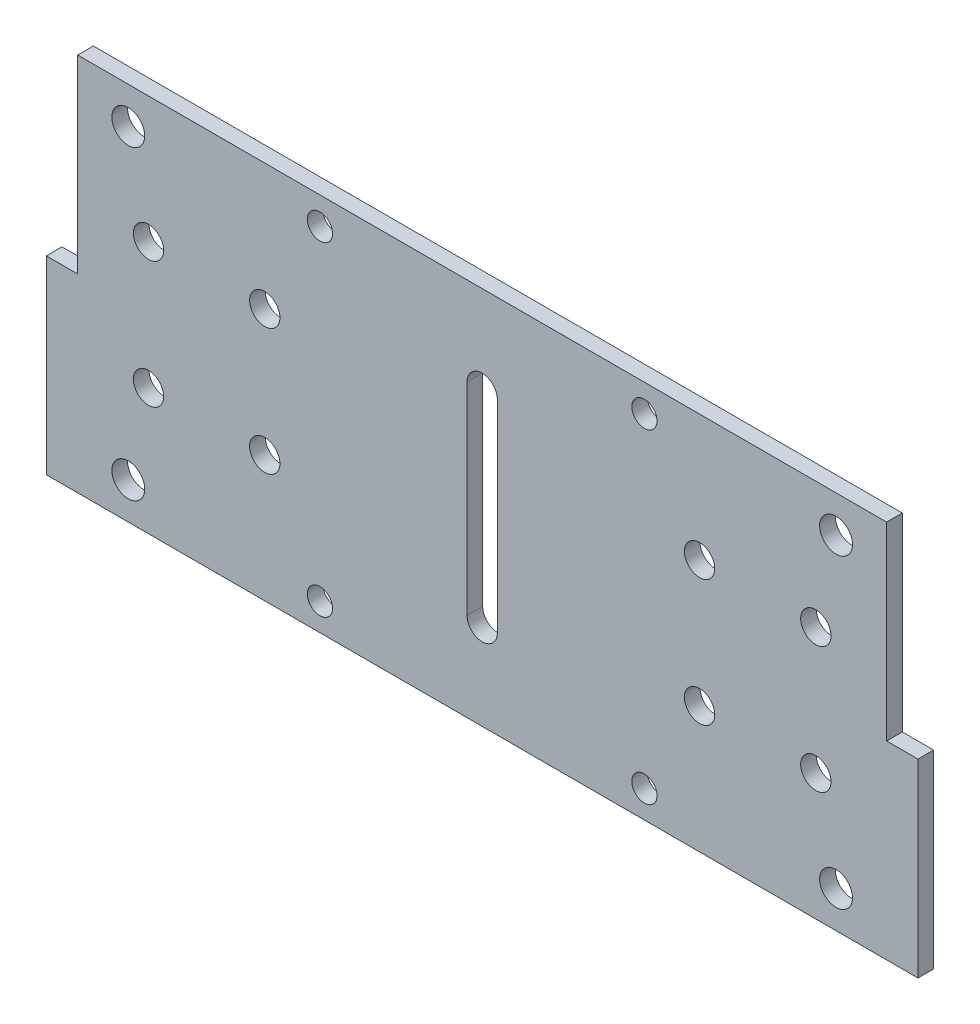
ISO-10303-21;
HEADER;
FILE_DESCRIPTION(('STEP AP214'),'2;1');
FILE_NAME('part.step','',(''),(''),'','','');
FILE_SCHEMA(('AUTOMOTIVE_DESIGN { 1 0 10303 214 1 1 1 1 }'));
ENDSEC;
DATA;
#1=APPLICATION_CONTEXT('core data for automotive mechanical design processes');
#2=APPLICATION_PROTOCOL_DEFINITION('international standard','automotive_design',2000,#1);
#3=PRODUCT_CONTEXT('',#1,'mechanical');
#4=PRODUCT('Part','Part','',(#3));
#5=PRODUCT_RELATED_PRODUCT_CATEGORY('part','',(#4));
#6=PRODUCT_DEFINITION_FORMATION('','',#4);
#7=PRODUCT_DEFINITION_CONTEXT('part definition',#1,'design');
#8=PRODUCT_DEFINITION('design','',#6,#7);
#9=PRODUCT_DEFINITION_SHAPE('','',#8);
#10=(LENGTH_UNIT() NAMED_UNIT(*) SI_UNIT(.MILLI.,.METRE.));
#11=(NAMED_UNIT(*) PLANE_ANGLE_UNIT() SI_UNIT($,.RADIAN.));
#12=(NAMED_UNIT(*) SI_UNIT($,.STERADIAN.) SOLID_ANGLE_UNIT());
#13=UNCERTAINTY_MEASURE_WITH_UNIT(LENGTH_MEASURE(1.E-05),#10,'distance_accuracy_value','');
#14=(GEOMETRIC_REPRESENTATION_CONTEXT(3) GLOBAL_UNCERTAINTY_ASSIGNED_CONTEXT((#13)) GLOBAL_UNIT_ASSIGNED_CONTEXT((#10,
#11,#12)) REPRESENTATION_CONTEXT('',''));
#15=CARTESIAN_POINT('',(0.,0.,0.));
#16=DIRECTION('',(0.,0.,1.));
#17=DIRECTION('',(1.,0.,0.));
#18=AXIS2_PLACEMENT_3D('',#15,#16,#17);
#19=CARTESIAN_POINT('',(80.,-37.5,3.1));
#20=DIRECTION('',(-1.,0.,0.));
#21=DIRECTION('',(0.,0.,1.));
#22=AXIS2_PLACEMENT_3D('',#19,#20,#21);
#23=PLANE('',#22);
#24=DIRECTION('',(0.,0.,1.));
#25=VECTOR('',#24,1.);
#26=CARTESIAN_POINT('',(80.,0.,0.));
#27=LINE('',#26,#25);
#28=CARTESIAN_POINT('',(80.,0.,0.));
#29=VERTEX_POINT('',#28);
#30=CARTESIAN_POINT('',(80.,0.,3.1));
#31=VERTEX_POINT('',#30);
#32=EDGE_CURVE('E304',#29,#31,#27,.T.);
#33=ORIENTED_EDGE('',*,*,#32,.F.);
#34=DIRECTION('',(0.,1.,0.));
#35=VECTOR('',#34,1.);
#36=CARTESIAN_POINT('',(80.,-37.5,0.));
#37=LINE('',#36,#35);
#38=CARTESIAN_POINT('',(80.,37.5,0.));
#39=VERTEX_POINT('',#38);
#40=EDGE_CURVE('E307',#29,#39,#37,.T.);
#41=ORIENTED_EDGE('',*,*,#40,.T.);
#42=DIRECTION('',(0.,0.,-1.));
#43=VECTOR('',#42,1.);
#44=CARTESIAN_POINT('',(80.,37.5,3.1));
#45=LINE('',#44,#43);
#46=CARTESIAN_POINT('',(80.,37.5,3.1));
#47=VERTEX_POINT('',#46);
#48=EDGE_CURVE('E200',#47,#39,#45,.T.);
#49=ORIENTED_EDGE('',*,*,#48,.F.);
#50=DIRECTION('',(0.,1.,0.));
#51=VECTOR('',#50,1.);
#52=CARTESIAN_POINT('',(80.,-37.5,3.1));
#53=LINE('',#52,#51);
#54=EDGE_CURVE('E309',#31,#47,#53,.T.);
#55=ORIENTED_EDGE('',*,*,#54,.F.);
#56=EDGE_LOOP('',(#33,#41,#49,#55));
#57=FACE_BOUND('',#56,.T.);
#58=ADVANCED_FACE('F32',(#57),#23,.F.);
#59=CARTESIAN_POINT('',(-80.,37.5,3.1));
#60=DIRECTION('',(0.,-1.,0.));
#61=DIRECTION('',(0.,0.,-1.));
#62=AXIS2_PLACEMENT_3D('',#59,#60,#61);
#63=PLANE('',#62);
#64=DIRECTION('',(-1.,0.,0.));
#65=VECTOR('',#64,1.);
#66=CARTESIAN_POINT('',(-80.,37.5,0.));
#67=LINE('',#66,#65);
#68=CARTESIAN_POINT('',(-80.,37.5,0.));
#69=VERTEX_POINT('',#68);
#70=EDGE_CURVE('E323',#39,#69,#67,.T.);
#71=ORIENTED_EDGE('',*,*,#70,.T.);
#72=DIRECTION('',(0.,0.,-1.));
#73=VECTOR('',#72,1.);
#74=CARTESIAN_POINT('',(-80.,37.5,3.1));
#75=LINE('',#74,#73);
#76=CARTESIAN_POINT('',(-80.,37.5,3.1));
#77=VERTEX_POINT('',#76);
#78=EDGE_CURVE('E350',#77,#69,#75,.T.);
#79=ORIENTED_EDGE('',*,*,#78,.F.);
#80=DIRECTION('',(-1.,0.,0.));
#81=VECTOR('',#80,1.);
#82=CARTESIAN_POINT('',(-80.,37.5,3.1));
#83=LINE('',#82,#81);
#84=EDGE_CURVE('E360',#47,#77,#83,.T.);
#85=ORIENTED_EDGE('',*,*,#84,.F.);
#86=ORIENTED_EDGE('',*,*,#48,.T.);
#87=EDGE_LOOP('',(#71,#79,#85,#86));
#88=FACE_BOUND('',#87,.T.);
#89=ADVANCED_FACE('F297',(#88),#63,.F.);
#90=CARTESIAN_POINT('',(-80.,-37.5,3.1));
#91=DIRECTION('',(1.,0.,0.));
#92=DIRECTION('',(0.,0.,-1.));
#93=AXIS2_PLACEMENT_3D('',#90,#91,#92);
#94=PLANE('',#93);
#95=DIRECTION('',(0.,-1.,0.));
#96=VECTOR('',#95,1.);
#97=CARTESIAN_POINT('',(-80.,-37.5,0.));
#98=LINE('',#97,#96);
#99=CARTESIAN_POINT('',(-80.,0.,0.));
#100=VERTEX_POINT('',#99);
#101=EDGE_CURVE('E338',#69,#100,#98,.T.);
#102=ORIENTED_EDGE('',*,*,#101,.T.);
#103=DIRECTION('',(0.,0.,1.));
#104=VECTOR('',#103,1.);
#105=CARTESIAN_POINT('',(-80.,0.,0.));
#106=LINE('',#105,#104);
#107=CARTESIAN_POINT('',(-80.,0.,3.1));
#108=VERTEX_POINT('',#107);
#109=EDGE_CURVE('E179',#100,#108,#106,.T.);
#110=ORIENTED_EDGE('',*,*,#109,.T.);
#111=DIRECTION('',(0.,-1.,0.));
#112=VECTOR('',#111,1.);
#113=CARTESIAN_POINT('',(-80.,-37.5,3.1));
#114=LINE('',#113,#112);
#115=EDGE_CURVE('E343',#77,#108,#114,.T.);
#116=ORIENTED_EDGE('',*,*,#115,.F.);
#117=ORIENTED_EDGE('',*,*,#78,.T.);
#118=EDGE_LOOP('',(#102,#110,#116,#117));
#119=FACE_BOUND('',#118,.T.);
#120=ADVANCED_FACE('F290',(#119),#94,.F.);
#121=CARTESIAN_POINT('',(-80.,-37.5,3.1));
#122=DIRECTION('',(0.,1.,0.));
#123=DIRECTION('',(0.,0.,1.));
#124=AXIS2_PLACEMENT_3D('',#121,#122,#123);
#125=PLANE('',#124);
#126=DIRECTION('',(1.,0.,0.));
#127=VECTOR('',#126,1.);
#128=CARTESIAN_POINT('',(-80.,-37.5,0.));
#129=LINE('',#128,#127);
#130=CARTESIAN_POINT('',(-86.2,-37.5,0.));
#131=VERTEX_POINT('',#130);
#132=CARTESIAN_POINT('',(86.2,-37.5,0.));
#133=VERTEX_POINT('',#132);
#134=EDGE_CURVE('E342',#131,#133,#129,.T.);
#135=ORIENTED_EDGE('',*,*,#134,.T.);
#136=DIRECTION('',(0.,0.,1.));
#137=VECTOR('',#136,1.);
#138=CARTESIAN_POINT('',(86.2,-37.5,0.));
#139=LINE('',#138,#137);
#140=CARTESIAN_POINT('',(86.2,-37.5,3.1));
#141=VERTEX_POINT('',#140);
#142=EDGE_CURVE('E314',#133,#141,#139,.T.);
#143=ORIENTED_EDGE('',*,*,#142,.T.);
#144=DIRECTION('',(1.,0.,0.));
#145=VECTOR('',#144,1.);
#146=CARTESIAN_POINT('',(-80.,-37.5,3.1));
#147=LINE('',#146,#145);
#148=CARTESIAN_POINT('',(-86.2,-37.5,3.1));
#149=VERTEX_POINT('',#148);
#150=EDGE_CURVE('E353',#149,#141,#147,.T.);
#151=ORIENTED_EDGE('',*,*,#150,.F.);
#152=DIRECTION('',(0.,0.,1.));
#153=VECTOR('',#152,1.);
#154=CARTESIAN_POINT('',(-86.2,-37.5,0.));
#155=LINE('',#154,#153);
#156=EDGE_CURVE('E176',#131,#149,#155,.T.);
#157=ORIENTED_EDGE('',*,*,#156,.F.);
#158=EDGE_LOOP('',(#135,#143,#151,#157));
#159=FACE_BOUND('',#158,.T.);
#160=ADVANCED_FACE('F280',(#159),#125,.F.);
#161=CARTESIAN_POINT('',(0.,0.,3.1));
#162=DIRECTION('',(0.,0.,-1.));
#163=DIRECTION('',(-1.,0.,0.));
#164=AXIS2_PLACEMENT_3D('',#161,#162,#163);
#165=PLANE('',#164);
#166=CARTESIAN_POINT('',(69.9999999999999,30.2588103111849,3.1));
#167=DIRECTION('',(0.,0.,1.));
#168=DIRECTION('',(1.,0.,0.));
#169=AXIS2_PLACEMENT_3D('',#166,#167,#168);
#170=CIRCLE('',#169,3.25000000000001);
#171=CARTESIAN_POINT('',(73.2499999999999,30.2588103111849,3.1));
#172=VERTEX_POINT('',#171);
#173=EDGE_CURVE('E254',#172,#172,#170,.T.);
#174=ORIENTED_EDGE('',*,*,#173,.F.);
#175=EDGE_LOOP('',(#174));
#176=FACE_BOUND('',#175,.T.);
#177=CARTESIAN_POINT('',(-70.,30.2588103111849,3.1));
#178=DIRECTION('',(0.,0.,1.));
#179=DIRECTION('',(-1.,0.,0.));
#180=AXIS2_PLACEMENT_3D('',#177,#178,#179);
#181=CIRCLE('',#180,3.25000000000001);
#182=CARTESIAN_POINT('',(-73.25,30.2588103111849,3.1));
#183=VERTEX_POINT('',#182);
#184=EDGE_CURVE('E244',#183,#183,#181,.T.);
#185=ORIENTED_EDGE('',*,*,#184,.F.);
#186=EDGE_LOOP('',(#185));
#187=FACE_BOUND('',#186,.T.);
#188=CARTESIAN_POINT('',(69.9999999999999,-30.2588103111849,3.1));
#189=DIRECTION('',(0.,0.,1.));
#190=DIRECTION('',(-1.,0.,0.));
#191=AXIS2_PLACEMENT_3D('',#188,#189,#190);
#192=CIRCLE('',#191,3.25000000000001);
#193=CARTESIAN_POINT('',(66.7499999999999,-30.2588103111849,3.1));
#194=VERTEX_POINT('',#193);
#195=EDGE_CURVE('E241',#194,#194,#192,.T.);
#196=ORIENTED_EDGE('',*,*,#195,.F.);
#197=EDGE_LOOP('',(#196));
#198=FACE_BOUND('',#197,.T.);
#199=CARTESIAN_POINT('',(-70.,-30.2588103111849,3.1));
#200=DIRECTION('',(0.,0.,1.));
#201=DIRECTION('',(1.,0.,0.));
#202=AXIS2_PLACEMENT_3D('',#199,#200,#201);
#203=CIRCLE('',#202,3.25000000000001);
#204=CARTESIAN_POINT('',(-66.75,-30.2588103111849,3.1));
#205=VERTEX_POINT('',#204);
#206=EDGE_CURVE('E238',#205,#205,#203,.T.);
#207=ORIENTED_EDGE('',*,*,#206,.F.);
#208=EDGE_LOOP('',(#207));
#209=FACE_BOUND('',#208,.T.);
#210=CARTESIAN_POINT('',(43.,-12.5,3.1));
#211=DIRECTION('',(0.,0.,1.));
#212=DIRECTION('',(1.,0.,0.));
#213=AXIS2_PLACEMENT_3D('',#210,#211,#212);
#214=CIRCLE('',#213,3.00000000000001);
#215=CARTESIAN_POINT('',(46.,-12.5,3.1));
#216=VERTEX_POINT('',#215);
#217=EDGE_CURVE('E234',#216,#216,#214,.T.);
#218=ORIENTED_EDGE('',*,*,#217,.F.);
#219=EDGE_LOOP('',(#218));
#220=FACE_BOUND('',#219,.T.);
#221=CARTESIAN_POINT('',(65.9999999999999,-12.5,3.1));
#222=DIRECTION('',(0.,0.,1.));
#223=DIRECTION('',(1.,0.,0.));
#224=AXIS2_PLACEMENT_3D('',#221,#222,#223);
#225=CIRCLE('',#224,3.00000000000001);
#226=CARTESIAN_POINT('',(68.9999999999999,-12.5,3.1));
#227=VERTEX_POINT('',#226);
#228=EDGE_CURVE('E230',#227,#227,#225,.T.);
#229=ORIENTED_EDGE('',*,*,#228,.F.);
#230=EDGE_LOOP('',(#229));
#231=FACE_BOUND('',#230,.T.);
#232=CARTESIAN_POINT('',(66.,12.5,3.1));
#233=DIRECTION('',(0.,0.,1.));
#234=DIRECTION('',(-1.,0.,0.));
#235=AXIS2_PLACEMENT_3D('',#232,#233,#234);
#236=CIRCLE('',#235,3.00000000000001);
#237=CARTESIAN_POINT('',(63.,12.5,3.1));
#238=VERTEX_POINT('',#237);
#239=EDGE_CURVE('E226',#238,#238,#236,.T.);
#240=ORIENTED_EDGE('',*,*,#239,.F.);
#241=EDGE_LOOP('',(#240));
#242=FACE_BOUND('',#241,.T.);
#243=CARTESIAN_POINT('',(43.,12.5,3.1));
#244=DIRECTION('',(0.,0.,1.));
#245=DIRECTION('',(-1.,0.,0.));
#246=AXIS2_PLACEMENT_3D('',#243,#244,#245);
#247=CIRCLE('',#246,3.00000000000001);
#248=CARTESIAN_POINT('',(40.,12.5,3.1));
#249=VERTEX_POINT('',#248);
#250=EDGE_CURVE('E222',#249,#249,#247,.T.);
#251=ORIENTED_EDGE('',*,*,#250,.F.);
#252=EDGE_LOOP('',(#251));
#253=FACE_BOUND('',#252,.T.);
#254=CARTESIAN_POINT('',(-66.,-12.5,3.1));
#255=DIRECTION('',(0.,0.,1.));
#256=DIRECTION('',(-1.,0.,0.));
#257=AXIS2_PLACEMENT_3D('',#254,#255,#256);
#258=CIRCLE('',#257,3.00000000000001);
#259=CARTESIAN_POINT('',(-69.,-12.5,3.1));
#260=VERTEX_POINT('',#259);
#261=EDGE_CURVE('E218',#260,#260,#258,.T.);
#262=ORIENTED_EDGE('',*,*,#261,.F.);
#263=EDGE_LOOP('',(#262));
#264=FACE_BOUND('',#263,.T.);
#265=CARTESIAN_POINT('',(-43.,-12.5,3.1));
#266=DIRECTION('',(0.,0.,1.));
#267=DIRECTION('',(-1.,0.,0.));
#268=AXIS2_PLACEMENT_3D('',#265,#266,#267);
#269=CIRCLE('',#268,3.00000000000001);
#270=CARTESIAN_POINT('',(-46.,-12.5,3.1));
#271=VERTEX_POINT('',#270);
#272=EDGE_CURVE('E214',#271,#271,#269,.T.);
#273=ORIENTED_EDGE('',*,*,#272,.F.);
#274=EDGE_LOOP('',(#273));
#275=FACE_BOUND('',#274,.T.);
#276=CARTESIAN_POINT('',(-43.,12.5,3.1));
#277=DIRECTION('',(0.,0.,1.));
#278=DIRECTION('',(1.,0.,0.));
#279=AXIS2_PLACEMENT_3D('',#276,#277,#278);
#280=CIRCLE('',#279,3.00000000000001);
#281=CARTESIAN_POINT('',(-40.,12.5,3.1));
#282=VERTEX_POINT('',#281);
#283=EDGE_CURVE('E210',#282,#282,#280,.T.);
#284=ORIENTED_EDGE('',*,*,#283,.F.);
#285=EDGE_LOOP('',(#284));
#286=FACE_BOUND('',#285,.T.);
#287=CARTESIAN_POINT('',(-66.,12.5,3.1));
#288=DIRECTION('',(0.,0.,1.));
#289=DIRECTION('',(1.,0.,0.));
#290=AXIS2_PLACEMENT_3D('',#287,#288,#289);
#291=CIRCLE('',#290,3.00000000000001);
#292=CARTESIAN_POINT('',(-63.,12.5,3.1));
#293=VERTEX_POINT('',#292);
#294=EDGE_CURVE('E206',#293,#293,#291,.T.);
#295=ORIENTED_EDGE('',*,*,#294,.F.);
#296=EDGE_LOOP('',(#295));
#297=FACE_BOUND('',#296,.T.);
#298=DIRECTION('',(0.,-1.,0.));
#299=VECTOR('',#298,1.);
#300=CARTESIAN_POINT('',(-3.00000000000001,-20.,3.1));
#301=LINE('',#300,#299);
#302=CARTESIAN_POINT('',(-3.00000000000001,20.,3.1));
#303=VERTEX_POINT('',#302);
#304=CARTESIAN_POINT('',(-3.00000000000001,-20.,3.1));
#305=VERTEX_POINT('',#304);
#306=EDGE_CURVE('E133',#303,#305,#301,.T.);
#307=ORIENTED_EDGE('',*,*,#306,.F.);
#308=CARTESIAN_POINT('',(0.,20.,3.1));
#309=DIRECTION('',(0.,0.,1.));
#310=DIRECTION('',(1.,0.,0.));
#311=AXIS2_PLACEMENT_3D('',#308,#309,#310);
#312=CIRCLE('',#311,3.);
#313=CARTESIAN_POINT('',(2.99999999999999,20.,3.1));
#314=VERTEX_POINT('',#313);
#315=EDGE_CURVE('E48',#314,#303,#312,.T.);
#316=ORIENTED_EDGE('',*,*,#315,.F.);
#317=DIRECTION('',(0.,1.,0.));
#318=VECTOR('',#317,1.);
#319=CARTESIAN_POINT('',(2.99999999999999,-20.,3.1));
#320=LINE('',#319,#318);
#321=CARTESIAN_POINT('',(2.99999999999999,-20.,3.1));
#322=VERTEX_POINT('',#321);
#323=EDGE_CURVE('E140',#322,#314,#320,.T.);
#324=ORIENTED_EDGE('',*,*,#323,.F.);
#325=CARTESIAN_POINT('',(0.,-20.,3.1));
#326=DIRECTION('',(0.,0.,1.));
#327=DIRECTION('',(-1.,0.,0.));
#328=AXIS2_PLACEMENT_3D('',#325,#326,#327);
#329=CIRCLE('',#328,3.);
#330=EDGE_CURVE('E124',#305,#322,#329,.T.);
#331=ORIENTED_EDGE('',*,*,#330,.F.);
#332=EDGE_LOOP('',(#307,#316,#324,#331));
#333=FACE_BOUND('',#332,.T.);
#334=CARTESIAN_POINT('',(-32.0895923599144,32.0895923599126,3.1));
#335=DIRECTION('',(0.,0.,1.));
#336=DIRECTION('',(1.,0.,0.));
#337=AXIS2_PLACEMENT_3D('',#334,#335,#336);
#338=CIRCLE('',#337,2.50000000000193);
#339=CARTESIAN_POINT('',(-29.5895923599124,32.0895923599126,3.1));
#340=VERTEX_POINT('',#339);
#341=EDGE_CURVE('E147',#340,#340,#338,.T.);
#342=ORIENTED_EDGE('',*,*,#341,.F.);
#343=EDGE_LOOP('',(#342));
#344=FACE_BOUND('',#343,.T.);
#345=CARTESIAN_POINT('',(-32.0895923599126,-32.0895923599161,3.1));
#346=DIRECTION('',(0.,0.,1.));
#347=DIRECTION('',(1.,0.,0.));
#348=AXIS2_PLACEMENT_3D('',#345,#346,#347);
#349=CIRCLE('',#348,2.50000000000133);
#350=CARTESIAN_POINT('',(-29.5895923599112,-32.0895923599161,3.1));
#351=VERTEX_POINT('',#350);
#352=EDGE_CURVE('E153',#351,#351,#349,.T.);
#353=ORIENTED_EDGE('',*,*,#352,.F.);
#354=EDGE_LOOP('',(#353));
#355=FACE_BOUND('',#354,.T.);
#356=CARTESIAN_POINT('',(32.0895923599161,-32.0895923599143,3.1));
#357=DIRECTION('',(0.,0.,1.));
#358=DIRECTION('',(1.,0.,0.));
#359=AXIS2_PLACEMENT_3D('',#356,#357,#358);
#360=CIRCLE('',#359,2.49999999999956);
#361=CARTESIAN_POINT('',(34.5895923599157,-32.0895923599143,3.1));
#362=VERTEX_POINT('',#361);
#363=EDGE_CURVE('E157',#362,#362,#360,.T.);
#364=ORIENTED_EDGE('',*,*,#363,.F.);
#365=EDGE_LOOP('',(#364));
#366=FACE_BOUND('',#365,.T.);
#367=CARTESIAN_POINT('',(32.0895923599143,32.0895923599143,3.1));
#368=DIRECTION('',(0.,0.,1.));
#369=DIRECTION('',(1.,0.,0.));
#370=AXIS2_PLACEMENT_3D('',#367,#368,#369);
#371=CIRCLE('',#370,2.5);
#372=CARTESIAN_POINT('',(34.5895923599143,32.0895923599143,3.1));
#373=VERTEX_POINT('',#372);
#374=EDGE_CURVE('E161',#373,#373,#371,.T.);
#375=ORIENTED_EDGE('',*,*,#374,.F.);
#376=EDGE_LOOP('',(#375));
#377=FACE_BOUND('',#376,.T.);
#378=ORIENTED_EDGE('',*,*,#150,.T.);
#379=DIRECTION('',(0.,1.,0.));
#380=VECTOR('',#379,1.);
#381=CARTESIAN_POINT('',(86.2,0.,3.1));
#382=LINE('',#381,#380);
#383=CARTESIAN_POINT('',(86.2,0.,3.1));
#384=VERTEX_POINT('',#383);
#385=EDGE_CURVE('E327',#141,#384,#382,.T.);
#386=ORIENTED_EDGE('',*,*,#385,.T.);
#387=DIRECTION('',(-1.,0.,0.));
#388=VECTOR('',#387,1.);
#389=CARTESIAN_POINT('',(80.,0.,3.1));
#390=LINE('',#389,#388);
#391=EDGE_CURVE('E183',#384,#31,#390,.T.);
#392=ORIENTED_EDGE('',*,*,#391,.T.);
#393=ORIENTED_EDGE('',*,*,#54,.T.);
#394=ORIENTED_EDGE('',*,*,#84,.T.);
#395=ORIENTED_EDGE('',*,*,#115,.T.);
#396=DIRECTION('',(-1.,0.,0.));
#397=VECTOR('',#396,1.);
#398=CARTESIAN_POINT('',(-80.,0.,3.1));
#399=LINE('',#398,#397);
#400=CARTESIAN_POINT('',(-86.2,0.,3.1));
#401=VERTEX_POINT('',#400);
#402=EDGE_CURVE('E173',#108,#401,#399,.T.);
#403=ORIENTED_EDGE('',*,*,#402,.T.);
#404=DIRECTION('',(0.,-1.,0.));
#405=VECTOR('',#404,1.);
#406=CARTESIAN_POINT('',(-86.2,0.,3.1));
#407=LINE('',#406,#405);
#408=EDGE_CURVE('E170',#401,#149,#407,.T.);
#409=ORIENTED_EDGE('',*,*,#408,.T.);
#410=EDGE_LOOP('',(#378,#386,#392,#393,#394,#395,#403,#409));
#411=FACE_BOUND('',#410,.T.);
#412=ADVANCED_FACE('F137',(#176,#187,#198,#209,#220,#231,#242,#253,#264,#275,#286,#297,#333,
#344,#355,#366,#377,#411),#165,.F.);
#413=CARTESIAN_POINT('',(0.,0.,0.));
#414=DIRECTION('',(0.,0.,-1.));
#415=DIRECTION('',(-1.,0.,0.));
#416=AXIS2_PLACEMENT_3D('',#413,#414,#415);
#417=PLANE('',#416);
#418=CARTESIAN_POINT('',(69.9999999999999,30.2588103111849,0.));
#419=DIRECTION('',(0.,0.,-1.));
#420=DIRECTION('',(-1.,0.,0.));
#421=AXIS2_PLACEMENT_3D('',#418,#419,#420);
#422=CIRCLE('',#421,3.25000000000001);
#423=CARTESIAN_POINT('',(66.7499999999999,30.2588103111849,0.));
#424=VERTEX_POINT('',#423);
#425=EDGE_CURVE('E35',#424,#424,#422,.T.);
#426=ORIENTED_EDGE('',*,*,#425,.F.);
#427=EDGE_LOOP('',(#426));
#428=FACE_BOUND('',#427,.T.);
#429=CARTESIAN_POINT('',(-70.,30.2588103111849,0.));
#430=DIRECTION('',(0.,0.,-1.));
#431=DIRECTION('',(-1.,0.,0.));
#432=AXIS2_PLACEMENT_3D('',#429,#430,#431);
#433=CIRCLE('',#432,3.25000000000001);
#434=CARTESIAN_POINT('',(-73.25,30.2588103111849,0.));
#435=VERTEX_POINT('',#434);
#436=EDGE_CURVE('E242',#435,#435,#433,.T.);
#437=ORIENTED_EDGE('',*,*,#436,.F.);
#438=EDGE_LOOP('',(#437));
#439=FACE_BOUND('',#438,.T.);
#440=CARTESIAN_POINT('',(69.9999999999999,-30.2588103111849,0.));
#441=DIRECTION('',(0.,0.,-1.));
#442=DIRECTION('',(-1.,0.,0.));
#443=AXIS2_PLACEMENT_3D('',#440,#441,#442);
#444=CIRCLE('',#443,3.25000000000001);
#445=CARTESIAN_POINT('',(66.7499999999999,-30.2588103111849,0.));
#446=VERTEX_POINT('',#445);
#447=EDGE_CURVE('E239',#446,#446,#444,.T.);
#448=ORIENTED_EDGE('',*,*,#447,.F.);
#449=EDGE_LOOP('',(#448));
#450=FACE_BOUND('',#449,.T.);
#451=CARTESIAN_POINT('',(-70.,-30.2588103111849,0.));
#452=DIRECTION('',(0.,0.,-1.));
#453=DIRECTION('',(-1.,0.,0.));
#454=AXIS2_PLACEMENT_3D('',#451,#452,#453);
#455=CIRCLE('',#454,3.25000000000001);
#456=CARTESIAN_POINT('',(-73.25,-30.2588103111849,0.));
#457=VERTEX_POINT('',#456);
#458=EDGE_CURVE('E235',#457,#457,#455,.T.);
#459=ORIENTED_EDGE('',*,*,#458,.F.);
#460=EDGE_LOOP('',(#459));
#461=FACE_BOUND('',#460,.T.);
#462=CARTESIAN_POINT('',(43.,-12.5,0.));
#463=DIRECTION('',(0.,0.,-1.));
#464=DIRECTION('',(-1.,0.,0.));
#465=AXIS2_PLACEMENT_3D('',#462,#463,#464);
#466=CIRCLE('',#465,3.00000000000001);
#467=CARTESIAN_POINT('',(40.,-12.5,0.));
#468=VERTEX_POINT('',#467);
#469=EDGE_CURVE('E231',#468,#468,#466,.T.);
#470=ORIENTED_EDGE('',*,*,#469,.F.);
#471=EDGE_LOOP('',(#470));
#472=FACE_BOUND('',#471,.T.);
#473=CARTESIAN_POINT('',(65.9999999999999,-12.5,0.));
#474=DIRECTION('',(0.,0.,-1.));
#475=DIRECTION('',(-1.,0.,0.));
#476=AXIS2_PLACEMENT_3D('',#473,#474,#475);
#477=CIRCLE('',#476,3.00000000000001);
#478=CARTESIAN_POINT('',(62.9999999999999,-12.5,0.));
#479=VERTEX_POINT('',#478);
#480=EDGE_CURVE('E227',#479,#479,#477,.T.);
#481=ORIENTED_EDGE('',*,*,#480,.F.);
#482=EDGE_LOOP('',(#481));
#483=FACE_BOUND('',#482,.T.);
#484=CARTESIAN_POINT('',(66.,12.5,0.));
#485=DIRECTION('',(0.,0.,-1.));
#486=DIRECTION('',(-1.,0.,0.));
#487=AXIS2_PLACEMENT_3D('',#484,#485,#486);
#488=CIRCLE('',#487,3.00000000000001);
#489=CARTESIAN_POINT('',(63.,12.5,0.));
#490=VERTEX_POINT('',#489);
#491=EDGE_CURVE('E223',#490,#490,#488,.T.);
#492=ORIENTED_EDGE('',*,*,#491,.F.);
#493=EDGE_LOOP('',(#492));
#494=FACE_BOUND('',#493,.T.);
#495=CARTESIAN_POINT('',(43.,12.5,0.));
#496=DIRECTION('',(0.,0.,-1.));
#497=DIRECTION('',(-1.,0.,0.));
#498=AXIS2_PLACEMENT_3D('',#495,#496,#497);
#499=CIRCLE('',#498,3.00000000000001);
#500=CARTESIAN_POINT('',(40.,12.5,0.));
#501=VERTEX_POINT('',#500);
#502=EDGE_CURVE('E219',#501,#501,#499,.T.);
#503=ORIENTED_EDGE('',*,*,#502,.F.);
#504=EDGE_LOOP('',(#503));
#505=FACE_BOUND('',#504,.T.);
#506=CARTESIAN_POINT('',(-66.,-12.5,0.));
#507=DIRECTION('',(0.,0.,-1.));
#508=DIRECTION('',(-1.,0.,0.));
#509=AXIS2_PLACEMENT_3D('',#506,#507,#508);
#510=CIRCLE('',#509,3.00000000000001);
#511=CARTESIAN_POINT('',(-69.,-12.5,0.));
#512=VERTEX_POINT('',#511);
#513=EDGE_CURVE('E215',#512,#512,#510,.T.);
#514=ORIENTED_EDGE('',*,*,#513,.F.);
#515=EDGE_LOOP('',(#514));
#516=FACE_BOUND('',#515,.T.);
#517=CARTESIAN_POINT('',(-43.,-12.5,0.));
#518=DIRECTION('',(0.,0.,-1.));
#519=DIRECTION('',(-1.,0.,0.));
#520=AXIS2_PLACEMENT_3D('',#517,#518,#519);
#521=CIRCLE('',#520,3.00000000000001);
#522=CARTESIAN_POINT('',(-46.,-12.5,0.));
#523=VERTEX_POINT('',#522);
#524=EDGE_CURVE('E211',#523,#523,#521,.T.);
#525=ORIENTED_EDGE('',*,*,#524,.F.);
#526=EDGE_LOOP('',(#525));
#527=FACE_BOUND('',#526,.T.);
#528=CARTESIAN_POINT('',(-43.,12.5,0.));
#529=DIRECTION('',(0.,0.,-1.));
#530=DIRECTION('',(-1.,0.,0.));
#531=AXIS2_PLACEMENT_3D('',#528,#529,#530);
#532=CIRCLE('',#531,3.00000000000001);
#533=CARTESIAN_POINT('',(-46.,12.5,0.));
#534=VERTEX_POINT('',#533);
#535=EDGE_CURVE('E207',#534,#534,#532,.T.);
#536=ORIENTED_EDGE('',*,*,#535,.F.);
#537=EDGE_LOOP('',(#536));
#538=FACE_BOUND('',#537,.T.);
#539=CARTESIAN_POINT('',(-66.,12.5,0.));
#540=DIRECTION('',(0.,0.,-1.));
#541=DIRECTION('',(-1.,0.,0.));
#542=AXIS2_PLACEMENT_3D('',#539,#540,#541);
#543=CIRCLE('',#542,3.00000000000001);
#544=CARTESIAN_POINT('',(-69.,12.5,0.));
#545=VERTEX_POINT('',#544);
#546=EDGE_CURVE('E203',#545,#545,#543,.T.);
#547=ORIENTED_EDGE('',*,*,#546,.F.);
#548=EDGE_LOOP('',(#547));
#549=FACE_BOUND('',#548,.T.);
#550=CARTESIAN_POINT('',(0.,20.,0.));
#551=DIRECTION('',(0.,0.,-1.));
#552=DIRECTION('',(-1.,0.,0.));
#553=AXIS2_PLACEMENT_3D('',#550,#551,#552);
#554=CIRCLE('',#553,3.);
#555=CARTESIAN_POINT('',(-3.00000000000001,20.,0.));
#556=VERTEX_POINT('',#555);
#557=CARTESIAN_POINT('',(2.99999999999999,20.,0.));
#558=VERTEX_POINT('',#557);
#559=EDGE_CURVE('E11',#556,#558,#554,.T.);
#560=ORIENTED_EDGE('',*,*,#559,.F.);
#561=DIRECTION('',(0.,1.,0.));
#562=VECTOR('',#561,1.);
#563=CARTESIAN_POINT('',(-3.00000000000001,0.,0.));
#564=LINE('',#563,#562);
#565=CARTESIAN_POINT('',(-3.00000000000001,-20.,0.));
#566=VERTEX_POINT('',#565);
#567=EDGE_CURVE('E198',#566,#556,#564,.T.);
#568=ORIENTED_EDGE('',*,*,#567,.F.);
#569=CARTESIAN_POINT('',(0.,-20.,0.));
#570=DIRECTION('',(0.,0.,-1.));
#571=DIRECTION('',(-1.,0.,0.));
#572=AXIS2_PLACEMENT_3D('',#569,#570,#571);
#573=CIRCLE('',#572,3.);
#574=CARTESIAN_POINT('',(2.99999999999999,-20.,0.));
#575=VERTEX_POINT('',#574);
#576=EDGE_CURVE('E127',#575,#566,#573,.T.);
#577=ORIENTED_EDGE('',*,*,#576,.F.);
#578=DIRECTION('',(0.,-1.,0.));
#579=VECTOR('',#578,1.);
#580=CARTESIAN_POINT('',(2.99999999999999,0.,0.));
#581=LINE('',#580,#579);
#582=EDGE_CURVE('E40',#558,#575,#581,.T.);
#583=ORIENTED_EDGE('',*,*,#582,.F.);
#584=EDGE_LOOP('',(#560,#568,#577,#583));
#585=FACE_BOUND('',#584,.T.);
#586=CARTESIAN_POINT('',(-32.0895923599144,32.0895923599126,0.));
#587=DIRECTION('',(0.,0.,-1.));
#588=DIRECTION('',(-1.,0.,0.));
#589=AXIS2_PLACEMENT_3D('',#586,#587,#588);
#590=CIRCLE('',#589,2.50000000000193);
#591=CARTESIAN_POINT('',(-34.5895923599163,32.0895923599126,0.));
#592=VERTEX_POINT('',#591);
#593=EDGE_CURVE('E152',#592,#592,#590,.T.);
#594=ORIENTED_EDGE('',*,*,#593,.F.);
#595=EDGE_LOOP('',(#594));
#596=FACE_BOUND('',#595,.T.);
#597=CARTESIAN_POINT('',(-32.0895923599126,-32.0895923599161,0.));
#598=DIRECTION('',(0.,0.,-1.));
#599=DIRECTION('',(-1.,0.,0.));
#600=AXIS2_PLACEMENT_3D('',#597,#598,#599);
#601=CIRCLE('',#600,2.50000000000133);
#602=CARTESIAN_POINT('',(-34.5895923599139,-32.0895923599161,0.));
#603=VERTEX_POINT('',#602);
#604=EDGE_CURVE('E156',#603,#603,#601,.T.);
#605=ORIENTED_EDGE('',*,*,#604,.F.);
#606=EDGE_LOOP('',(#605));
#607=FACE_BOUND('',#606,.T.);
#608=CARTESIAN_POINT('',(32.0895923599161,-32.0895923599143,0.));
#609=DIRECTION('',(0.,0.,-1.));
#610=DIRECTION('',(-1.,0.,0.));
#611=AXIS2_PLACEMENT_3D('',#608,#609,#610);
#612=CIRCLE('',#611,2.49999999999956);
#613=CARTESIAN_POINT('',(29.5895923599166,-32.0895923599143,0.));
#614=VERTEX_POINT('',#613);
#615=EDGE_CURVE('E160',#614,#614,#612,.T.);
#616=ORIENTED_EDGE('',*,*,#615,.F.);
#617=EDGE_LOOP('',(#616));
#618=FACE_BOUND('',#617,.T.);
#619=CARTESIAN_POINT('',(32.0895923599143,32.0895923599143,0.));
#620=DIRECTION('',(0.,0.,-1.));
#621=DIRECTION('',(-1.,0.,0.));
#622=AXIS2_PLACEMENT_3D('',#619,#620,#621);
#623=CIRCLE('',#622,2.5);
#624=CARTESIAN_POINT('',(29.5895923599143,32.0895923599143,0.));
#625=VERTEX_POINT('',#624);
#626=EDGE_CURVE('E164',#625,#625,#623,.T.);
#627=ORIENTED_EDGE('',*,*,#626,.F.);
#628=EDGE_LOOP('',(#627));
#629=FACE_BOUND('',#628,.T.);
#630=ORIENTED_EDGE('',*,*,#40,.F.);
#631=DIRECTION('',(-1.,0.,0.));
#632=VECTOR('',#631,1.);
#633=CARTESIAN_POINT('',(80.,0.,0.));
#634=LINE('',#633,#632);
#635=CARTESIAN_POINT('',(86.2,0.,0.));
#636=VERTEX_POINT('',#635);
#637=EDGE_CURVE('E320',#636,#29,#634,.T.);
#638=ORIENTED_EDGE('',*,*,#637,.F.);
#639=DIRECTION('',(0.,1.,0.));
#640=VECTOR('',#639,1.);
#641=CARTESIAN_POINT('',(86.2,0.,0.));
#642=LINE('',#641,#640);
#643=EDGE_CURVE('E315',#133,#636,#642,.T.);
#644=ORIENTED_EDGE('',*,*,#643,.F.);
#645=ORIENTED_EDGE('',*,*,#134,.F.);
#646=DIRECTION('',(0.,-1.,0.));
#647=VECTOR('',#646,1.);
#648=CARTESIAN_POINT('',(-86.2,0.,0.));
#649=LINE('',#648,#647);
#650=CARTESIAN_POINT('',(-86.2,0.,0.));
#651=VERTEX_POINT('',#650);
#652=EDGE_CURVE('E165',#651,#131,#649,.T.);
#653=ORIENTED_EDGE('',*,*,#652,.F.);
#654=DIRECTION('',(-1.,0.,0.));
#655=VECTOR('',#654,1.);
#656=CARTESIAN_POINT('',(-80.,0.,0.));
#657=LINE('',#656,#655);
#658=EDGE_CURVE('E169',#100,#651,#657,.T.);
#659=ORIENTED_EDGE('',*,*,#658,.F.);
#660=ORIENTED_EDGE('',*,*,#101,.F.);
#661=ORIENTED_EDGE('',*,*,#70,.F.);
#662=EDGE_LOOP('',(#630,#638,#644,#645,#653,#659,#660,#661));
#663=FACE_BOUND('',#662,.T.);
#664=ADVANCED_FACE('F279',(#428,#439,#450,#461,#472,#483,#494,#505,#516,#527,#538,#549,#585,
#596,#607,#618,#629,#663),#417,.T.);
#665=CARTESIAN_POINT('',(80.,0.,0.));
#666=DIRECTION('',(0.,1.,0.));
#667=DIRECTION('',(-1.,0.,0.));
#668=AXIS2_PLACEMENT_3D('',#665,#666,#667);
#669=PLANE('',#668);
#670=ORIENTED_EDGE('',*,*,#391,.F.);
#671=DIRECTION('',(0.,0.,1.));
#672=VECTOR('',#671,1.);
#673=CARTESIAN_POINT('',(86.2,0.,0.));
#674=LINE('',#673,#672);
#675=EDGE_CURVE('E325',#636,#384,#674,.T.);
#676=ORIENTED_EDGE('',*,*,#675,.F.);
#677=ORIENTED_EDGE('',*,*,#637,.T.);
#678=ORIENTED_EDGE('',*,*,#32,.T.);
#679=EDGE_LOOP('',(#670,#676,#677,#678));
#680=FACE_BOUND('',#679,.T.);
#681=ADVANCED_FACE('F287',(#680),#669,.T.);
#682=CARTESIAN_POINT('',(86.2,0.,0.));
#683=DIRECTION('',(1.,0.,0.));
#684=DIRECTION('',(0.,0.,-1.));
#685=AXIS2_PLACEMENT_3D('',#682,#683,#684);
#686=PLANE('',#685);
#687=ORIENTED_EDGE('',*,*,#385,.F.);
#688=ORIENTED_EDGE('',*,*,#142,.F.);
#689=ORIENTED_EDGE('',*,*,#643,.T.);
#690=ORIENTED_EDGE('',*,*,#675,.T.);
#691=EDGE_LOOP('',(#687,#688,#689,#690));
#692=FACE_BOUND('',#691,.T.);
#693=ADVANCED_FACE('F372',(#692),#686,.T.);
#694=CARTESIAN_POINT('',(-80.,0.,0.));
#695=DIRECTION('',(0.,1.,0.));
#696=DIRECTION('',(-1.,0.,0.));
#697=AXIS2_PLACEMENT_3D('',#694,#695,#696);
#698=PLANE('',#697);
#699=ORIENTED_EDGE('',*,*,#402,.F.);
#700=ORIENTED_EDGE('',*,*,#109,.F.);
#701=ORIENTED_EDGE('',*,*,#658,.T.);
#702=DIRECTION('',(0.,0.,1.));
#703=VECTOR('',#702,1.);
#704=CARTESIAN_POINT('',(-86.2,0.,0.));
#705=LINE('',#704,#703);
#706=EDGE_CURVE('E168',#651,#401,#705,.T.);
#707=ORIENTED_EDGE('',*,*,#706,.T.);
#708=EDGE_LOOP('',(#699,#700,#701,#707));
#709=FACE_BOUND('',#708,.T.);
#710=ADVANCED_FACE('F383',(#709),#698,.T.);
#711=CARTESIAN_POINT('',(-86.2,0.,0.));
#712=DIRECTION('',(-1.,0.,0.));
#713=DIRECTION('',(0.,0.,1.));
#714=AXIS2_PLACEMENT_3D('',#711,#712,#713);
#715=PLANE('',#714);
#716=ORIENTED_EDGE('',*,*,#408,.F.);
#717=ORIENTED_EDGE('',*,*,#706,.F.);
#718=ORIENTED_EDGE('',*,*,#652,.T.);
#719=ORIENTED_EDGE('',*,*,#156,.T.);
#720=EDGE_LOOP('',(#716,#717,#718,#719));
#721=FACE_BOUND('',#720,.T.);
#722=ADVANCED_FACE('F378',(#721),#715,.T.);
#723=CARTESIAN_POINT('',(32.0895923599143,32.0895923599143,-5.00000000001367E-05));
#724=DIRECTION('',(0.,0.,1.));
#725=DIRECTION('',(1.,0.,0.));
#726=AXIS2_PLACEMENT_3D('',#723,#724,#725);
#727=CYLINDRICAL_SURFACE('',#726,2.5);
#728=ORIENTED_EDGE('',*,*,#626,.T.);
#729=EDGE_LOOP('',(#728));
#730=FACE_BOUND('',#729,.T.);
#731=ORIENTED_EDGE('',*,*,#374,.T.);
#732=EDGE_LOOP('',(#731));
#733=FACE_BOUND('',#732,.T.);
#734=ADVANCED_FACE('F431',(#730,#733),#727,.F.);
#735=CARTESIAN_POINT('',(32.0895923599161,-32.0895923599143,-5.00000000001367E-05));
#736=DIRECTION('',(0.,0.,1.));
#737=DIRECTION('',(1.,0.,0.));
#738=AXIS2_PLACEMENT_3D('',#735,#736,#737);
#739=CYLINDRICAL_SURFACE('',#738,2.49999999999956);
#740=ORIENTED_EDGE('',*,*,#615,.T.);
#741=EDGE_LOOP('',(#740));
#742=FACE_BOUND('',#741,.T.);
#743=ORIENTED_EDGE('',*,*,#363,.T.);
#744=EDGE_LOOP('',(#743));
#745=FACE_BOUND('',#744,.T.);
#746=ADVANCED_FACE('F451',(#742,#745),#739,.F.);
#747=CARTESIAN_POINT('',(-32.0895923599126,-32.0895923599161,-5.00000000001367E-05));
#748=DIRECTION('',(0.,0.,1.));
#749=DIRECTION('',(1.,0.,0.));
#750=AXIS2_PLACEMENT_3D('',#747,#748,#749);
#751=CYLINDRICAL_SURFACE('',#750,2.50000000000133);
#752=ORIENTED_EDGE('',*,*,#604,.T.);
#753=EDGE_LOOP('',(#752));
#754=FACE_BOUND('',#753,.T.);
#755=ORIENTED_EDGE('',*,*,#352,.T.);
#756=EDGE_LOOP('',(#755));
#757=FACE_BOUND('',#756,.T.);
#758=ADVANCED_FACE('F461',(#754,#757),#751,.F.);
#759=CARTESIAN_POINT('',(-32.0895923599144,32.0895923599126,-5.00000000001367E-05));
#760=DIRECTION('',(0.,0.,1.));
#761=DIRECTION('',(1.,0.,0.));
#762=AXIS2_PLACEMENT_3D('',#759,#760,#761);
#763=CYLINDRICAL_SURFACE('',#762,2.50000000000193);
#764=ORIENTED_EDGE('',*,*,#593,.T.);
#765=EDGE_LOOP('',(#764));
#766=FACE_BOUND('',#765,.T.);
#767=ORIENTED_EDGE('',*,*,#341,.T.);
#768=EDGE_LOOP('',(#767));
#769=FACE_BOUND('',#768,.T.);
#770=ADVANCED_FACE('F471',(#766,#769),#763,.F.);
#771=CARTESIAN_POINT('',(0.,20.,-5.00000000001367E-05));
#772=DIRECTION('',(0.,0.,1.));
#773=DIRECTION('',(1.,0.,0.));
#774=AXIS2_PLACEMENT_3D('',#771,#772,#773);
#775=CYLINDRICAL_SURFACE('',#774,3.);
#776=ORIENTED_EDGE('',*,*,#559,.T.);
#777=DIRECTION('',(0.,0.,1.));
#778=VECTOR('',#777,1.);
#779=CARTESIAN_POINT('',(2.99999999999999,20.,-5.00000000001367E-05));
#780=LINE('',#779,#778);
#781=EDGE_CURVE('E145',#558,#314,#780,.T.);
#782=ORIENTED_EDGE('',*,*,#781,.T.);
#783=ORIENTED_EDGE('',*,*,#315,.T.);
#784=DIRECTION('',(0.,0.,1.));
#785=VECTOR('',#784,1.);
#786=CARTESIAN_POINT('',(-3.00000000000001,20.,-5.00000000001367E-05));
#787=LINE('',#786,#785);
#788=EDGE_CURVE('E130',#556,#303,#787,.T.);
#789=ORIENTED_EDGE('',*,*,#788,.F.);
#790=EDGE_LOOP('',(#776,#782,#783,#789));
#791=FACE_BOUND('',#790,.T.);
#792=ADVANCED_FACE('F481',(#791),#775,.F.);
#793=CARTESIAN_POINT('',(2.99999999999999,-20.,-5.00000000001367E-05));
#794=DIRECTION('',(1.,0.,0.));
#795=DIRECTION('',(0.,0.,-1.));
#796=AXIS2_PLACEMENT_3D('',#793,#794,#795);
#797=PLANE('',#796);
#798=ORIENTED_EDGE('',*,*,#582,.T.);
#799=DIRECTION('',(0.,0.,1.));
#800=VECTOR('',#799,1.);
#801=CARTESIAN_POINT('',(2.99999999999999,-20.,-5.00000000001367E-05));
#802=LINE('',#801,#800);
#803=EDGE_CURVE('E129',#575,#322,#802,.T.);
#804=ORIENTED_EDGE('',*,*,#803,.T.);
#805=ORIENTED_EDGE('',*,*,#323,.T.);
#806=ORIENTED_EDGE('',*,*,#781,.F.);
#807=EDGE_LOOP('',(#798,#804,#805,#806));
#808=FACE_BOUND('',#807,.T.);
#809=ADVANCED_FACE('F491',(#808),#797,.F.);
#810=CARTESIAN_POINT('',(0.,-20.,-5.00000000001367E-05));
#811=DIRECTION('',(0.,0.,1.));
#812=DIRECTION('',(1.,0.,0.));
#813=AXIS2_PLACEMENT_3D('',#810,#811,#812);
#814=CYLINDRICAL_SURFACE('',#813,3.);
#815=ORIENTED_EDGE('',*,*,#576,.T.);
#816=DIRECTION('',(0.,0.,1.));
#817=VECTOR('',#816,1.);
#818=CARTESIAN_POINT('',(-3.00000000000001,-20.,-5.00000000001367E-05));
#819=LINE('',#818,#817);
#820=EDGE_CURVE('E56',#566,#305,#819,.T.);
#821=ORIENTED_EDGE('',*,*,#820,.T.);
#822=ORIENTED_EDGE('',*,*,#330,.T.);
#823=ORIENTED_EDGE('',*,*,#803,.F.);
#824=EDGE_LOOP('',(#815,#821,#822,#823));
#825=FACE_BOUND('',#824,.T.);
#826=ADVANCED_FACE('F121',(#825),#814,.F.);
#827=CARTESIAN_POINT('',(-3.00000000000001,-20.,-5.00000000001367E-05));
#828=DIRECTION('',(-1.,0.,0.));
#829=DIRECTION('',(0.,0.,1.));
#830=AXIS2_PLACEMENT_3D('',#827,#828,#829);
#831=PLANE('',#830);
#832=ORIENTED_EDGE('',*,*,#567,.T.);
#833=ORIENTED_EDGE('',*,*,#788,.T.);
#834=ORIENTED_EDGE('',*,*,#306,.T.);
#835=ORIENTED_EDGE('',*,*,#820,.F.);
#836=EDGE_LOOP('',(#832,#833,#834,#835));
#837=FACE_BOUND('',#836,.T.);
#838=ADVANCED_FACE('F134',(#837),#831,.F.);
#839=CARTESIAN_POINT('',(-66.,12.5,-5.00000000001367E-05));
#840=DIRECTION('',(0.,0.,1.));
#841=DIRECTION('',(1.,0.,0.));
#842=AXIS2_PLACEMENT_3D('',#839,#840,#841);
#843=CYLINDRICAL_SURFACE('',#842,3.00000000000001);
#844=ORIENTED_EDGE('',*,*,#546,.T.);
#845=EDGE_LOOP('',(#844));
#846=FACE_BOUND('',#845,.T.);
#847=ORIENTED_EDGE('',*,*,#294,.T.);
#848=EDGE_LOOP('',(#847));
#849=FACE_BOUND('',#848,.T.);
#850=ADVANCED_FACE('F276',(#846,#849),#843,.F.);
#851=CARTESIAN_POINT('',(-43.,12.5,-5.00000000001367E-05));
#852=DIRECTION('',(0.,0.,1.));
#853=DIRECTION('',(1.,0.,0.));
#854=AXIS2_PLACEMENT_3D('',#851,#852,#853);
#855=CYLINDRICAL_SURFACE('',#854,3.00000000000001);
#856=ORIENTED_EDGE('',*,*,#535,.T.);
#857=EDGE_LOOP('',(#856));
#858=FACE_BOUND('',#857,.T.);
#859=ORIENTED_EDGE('',*,*,#283,.T.);
#860=EDGE_LOOP('',(#859));
#861=FACE_BOUND('',#860,.T.);
#862=ADVANCED_FACE('F525',(#858,#861),#855,.F.);
#863=CARTESIAN_POINT('',(-43.,-12.5,-5.00000000001367E-05));
#864=DIRECTION('',(0.,0.,1.));
#865=DIRECTION('',(1.,0.,0.));
#866=AXIS2_PLACEMENT_3D('',#863,#864,#865);
#867=CYLINDRICAL_SURFACE('',#866,3.00000000000001);
#868=ORIENTED_EDGE('',*,*,#524,.T.);
#869=EDGE_LOOP('',(#868));
#870=FACE_BOUND('',#869,.T.);
#871=ORIENTED_EDGE('',*,*,#272,.T.);
#872=EDGE_LOOP('',(#871));
#873=FACE_BOUND('',#872,.T.);
#874=ADVANCED_FACE('F535',(#870,#873),#867,.F.);
#875=CARTESIAN_POINT('',(-66.,-12.5,-5.00000000001367E-05));
#876=DIRECTION('',(0.,0.,1.));
#877=DIRECTION('',(1.,0.,0.));
#878=AXIS2_PLACEMENT_3D('',#875,#876,#877);
#879=CYLINDRICAL_SURFACE('',#878,3.00000000000001);
#880=ORIENTED_EDGE('',*,*,#513,.T.);
#881=EDGE_LOOP('',(#880));
#882=FACE_BOUND('',#881,.T.);
#883=ORIENTED_EDGE('',*,*,#261,.T.);
#884=EDGE_LOOP('',(#883));
#885=FACE_BOUND('',#884,.T.);
#886=ADVANCED_FACE('F545',(#882,#885),#879,.F.);
#887=CARTESIAN_POINT('',(43.,12.5,-5.00000000001367E-05));
#888=DIRECTION('',(0.,0.,1.));
#889=DIRECTION('',(1.,0.,0.));
#890=AXIS2_PLACEMENT_3D('',#887,#888,#889);
#891=CYLINDRICAL_SURFACE('',#890,3.00000000000001);
#892=ORIENTED_EDGE('',*,*,#502,.T.);
#893=EDGE_LOOP('',(#892));
#894=FACE_BOUND('',#893,.T.);
#895=ORIENTED_EDGE('',*,*,#250,.T.);
#896=EDGE_LOOP('',(#895));
#897=FACE_BOUND('',#896,.T.);
#898=ADVANCED_FACE('F555',(#894,#897),#891,.F.);
#899=CARTESIAN_POINT('',(66.,12.5,-5.00000000001367E-05));
#900=DIRECTION('',(0.,0.,1.));
#901=DIRECTION('',(1.,0.,0.));
#902=AXIS2_PLACEMENT_3D('',#899,#900,#901);
#903=CYLINDRICAL_SURFACE('',#902,3.00000000000001);
#904=ORIENTED_EDGE('',*,*,#491,.T.);
#905=EDGE_LOOP('',(#904));
#906=FACE_BOUND('',#905,.T.);
#907=ORIENTED_EDGE('',*,*,#239,.T.);
#908=EDGE_LOOP('',(#907));
#909=FACE_BOUND('',#908,.T.);
#910=ADVANCED_FACE('F565',(#906,#909),#903,.F.);
#911=CARTESIAN_POINT('',(65.9999999999999,-12.5,-5.00000000001367E-05));
#912=DIRECTION('',(0.,0.,1.));
#913=DIRECTION('',(1.,0.,0.));
#914=AXIS2_PLACEMENT_3D('',#911,#912,#913);
#915=CYLINDRICAL_SURFACE('',#914,3.00000000000001);
#916=ORIENTED_EDGE('',*,*,#480,.T.);
#917=EDGE_LOOP('',(#916));
#918=FACE_BOUND('',#917,.T.);
#919=ORIENTED_EDGE('',*,*,#228,.T.);
#920=EDGE_LOOP('',(#919));
#921=FACE_BOUND('',#920,.T.);
#922=ADVANCED_FACE('F575',(#918,#921),#915,.F.);
#923=CARTESIAN_POINT('',(43.,-12.5,-5.00000000001367E-05));
#924=DIRECTION('',(0.,0.,1.));
#925=DIRECTION('',(1.,0.,0.));
#926=AXIS2_PLACEMENT_3D('',#923,#924,#925);
#927=CYLINDRICAL_SURFACE('',#926,3.00000000000001);
#928=ORIENTED_EDGE('',*,*,#469,.T.);
#929=EDGE_LOOP('',(#928));
#930=FACE_BOUND('',#929,.T.);
#931=ORIENTED_EDGE('',*,*,#217,.T.);
#932=EDGE_LOOP('',(#931));
#933=FACE_BOUND('',#932,.T.);
#934=ADVANCED_FACE('F585',(#930,#933),#927,.F.);
#935=CARTESIAN_POINT('',(-70.,-30.2588103111849,-5.00000000001367E-05));
#936=DIRECTION('',(0.,0.,1.));
#937=DIRECTION('',(1.,0.,0.));
#938=AXIS2_PLACEMENT_3D('',#935,#936,#937);
#939=CYLINDRICAL_SURFACE('',#938,3.25000000000001);
#940=ORIENTED_EDGE('',*,*,#458,.T.);
#941=EDGE_LOOP('',(#940));
#942=FACE_BOUND('',#941,.T.);
#943=ORIENTED_EDGE('',*,*,#206,.T.);
#944=EDGE_LOOP('',(#943));
#945=FACE_BOUND('',#944,.T.);
#946=ADVANCED_FACE('F595',(#942,#945),#939,.F.);
#947=CARTESIAN_POINT('',(69.9999999999999,-30.2588103111849,-5.00000000001367E-05));
#948=DIRECTION('',(0.,0.,1.));
#949=DIRECTION('',(1.,0.,0.));
#950=AXIS2_PLACEMENT_3D('',#947,#948,#949);
#951=CYLINDRICAL_SURFACE('',#950,3.25000000000001);
#952=ORIENTED_EDGE('',*,*,#447,.T.);
#953=EDGE_LOOP('',(#952));
#954=FACE_BOUND('',#953,.T.);
#955=ORIENTED_EDGE('',*,*,#195,.T.);
#956=EDGE_LOOP('',(#955));
#957=FACE_BOUND('',#956,.T.);
#958=ADVANCED_FACE('F605',(#954,#957),#951,.F.);
#959=CARTESIAN_POINT('',(-70.,30.2588103111849,-5.00000000001367E-05));
#960=DIRECTION('',(0.,0.,1.));
#961=DIRECTION('',(1.,0.,0.));
#962=AXIS2_PLACEMENT_3D('',#959,#960,#961);
#963=CYLINDRICAL_SURFACE('',#962,3.25000000000001);
#964=ORIENTED_EDGE('',*,*,#436,.T.);
#965=EDGE_LOOP('',(#964));
#966=FACE_BOUND('',#965,.T.);
#967=ORIENTED_EDGE('',*,*,#184,.T.);
#968=EDGE_LOOP('',(#967));
#969=FACE_BOUND('',#968,.T.);
#970=ADVANCED_FACE('F615',(#966,#969),#963,.F.);
#971=CARTESIAN_POINT('',(69.9999999999999,30.2588103111849,-5.00000000001367E-05));
#972=DIRECTION('',(0.,0.,1.));
#973=DIRECTION('',(1.,0.,0.));
#974=AXIS2_PLACEMENT_3D('',#971,#972,#973);
#975=CYLINDRICAL_SURFACE('',#974,3.25000000000001);
#976=ORIENTED_EDGE('',*,*,#425,.T.);
#977=EDGE_LOOP('',(#976));
#978=FACE_BOUND('',#977,.T.);
#979=ORIENTED_EDGE('',*,*,#173,.T.);
#980=EDGE_LOOP('',(#979));
#981=FACE_BOUND('',#980,.T.);
#982=ADVANCED_FACE('F625',(#978,#981),#975,.F.);
#983=CLOSED_SHELL('',(#58,#89,#120,#160,#412,#664,#681,#693,#710,#722,#734,#746,#758,#770,#792,
#809,#826,#838,#850,#862,#874,#886,#898,#910,#922,#934,#946,#958,#970,#982));
#984=MANIFOLD_SOLID_BREP('B2',#983);
#985=ADVANCED_BREP_SHAPE_REPRESENTATION('',(#18,#984),#14);
#986=SHAPE_DEFINITION_REPRESENTATION(#9,#985);
ENDSEC;
END-ISO-10303-21;
